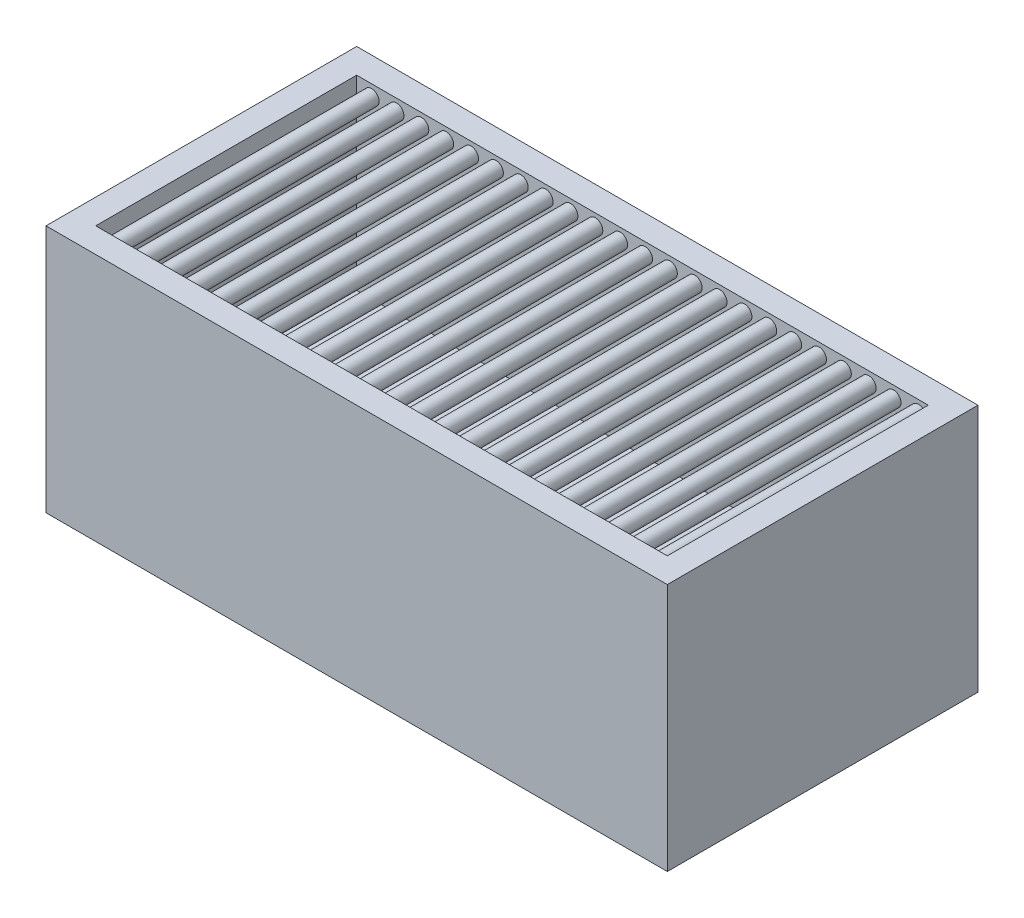
ISO-10303-21;
HEADER;
FILE_DESCRIPTION(('STEP AP214'),'2;1');
FILE_NAME('part.step','',(''),(''),'','','');
FILE_SCHEMA(('AUTOMOTIVE_DESIGN { 1 0 10303 214 1 1 1 1 }'));
ENDSEC;
DATA;
#1=APPLICATION_CONTEXT('core data for automotive mechanical design processes');
#2=APPLICATION_PROTOCOL_DEFINITION('international standard','automotive_design',2000,#1);
#3=PRODUCT_CONTEXT('',#1,'mechanical');
#4=PRODUCT('Part','Part','',(#3));
#5=PRODUCT_RELATED_PRODUCT_CATEGORY('part','',(#4));
#6=PRODUCT_DEFINITION_FORMATION('','',#4);
#7=PRODUCT_DEFINITION_CONTEXT('part definition',#1,'design');
#8=PRODUCT_DEFINITION('design','',#6,#7);
#9=PRODUCT_DEFINITION_SHAPE('','',#8);
#10=(LENGTH_UNIT() NAMED_UNIT(*) SI_UNIT(.MILLI.,.METRE.));
#11=(NAMED_UNIT(*) PLANE_ANGLE_UNIT() SI_UNIT($,.RADIAN.));
#12=(NAMED_UNIT(*) SI_UNIT($,.STERADIAN.) SOLID_ANGLE_UNIT());
#13=UNCERTAINTY_MEASURE_WITH_UNIT(LENGTH_MEASURE(1.E-05),#10,'distance_accuracy_value','');
#14=(GEOMETRIC_REPRESENTATION_CONTEXT(3) GLOBAL_UNCERTAINTY_ASSIGNED_CONTEXT((#13)) GLOBAL_UNIT_ASSIGNED_CONTEXT((#10,
#11,#12)) REPRESENTATION_CONTEXT('',''));
#15=CARTESIAN_POINT('',(0.,0.,0.));
#16=DIRECTION('',(0.,0.,1.));
#17=DIRECTION('',(1.,0.,0.));
#18=AXIS2_PLACEMENT_3D('',#15,#16,#17);
#19=CARTESIAN_POINT('',(-25.,20.,12.5));
#20=DIRECTION('',(1.,0.,0.));
#21=DIRECTION('',(0.,1.,0.));
#22=AXIS2_PLACEMENT_3D('',#19,#20,#21);
#23=PLANE('',#22);
#24=DIRECTION('',(0.,-1.,0.));
#25=VECTOR('',#24,1.);
#26=CARTESIAN_POINT('',(-25.,20.,-12.5));
#27=LINE('',#26,#25);
#28=CARTESIAN_POINT('',(-25.,20.,-12.5));
#29=VERTEX_POINT('',#28);
#30=CARTESIAN_POINT('',(-25.,0.,-12.5));
#31=VERTEX_POINT('',#30);
#32=EDGE_CURVE('E145',#29,#31,#27,.T.);
#33=ORIENTED_EDGE('',*,*,#32,.T.);
#34=DIRECTION('',(0.,0.,-1.));
#35=VECTOR('',#34,1.);
#36=CARTESIAN_POINT('',(-25.,0.,12.5));
#37=LINE('',#36,#35);
#38=CARTESIAN_POINT('',(-25.,0.,12.5));
#39=VERTEX_POINT('',#38);
#40=EDGE_CURVE('E11',#39,#31,#37,.T.);
#41=ORIENTED_EDGE('',*,*,#40,.F.);
#42=DIRECTION('',(0.,-1.,0.));
#43=VECTOR('',#42,1.);
#44=CARTESIAN_POINT('',(-25.,20.,12.5));
#45=LINE('',#44,#43);
#46=CARTESIAN_POINT('',(-25.,20.,12.5));
#47=VERTEX_POINT('',#46);
#48=EDGE_CURVE('E149',#47,#39,#45,.T.);
#49=ORIENTED_EDGE('',*,*,#48,.F.);
#50=DIRECTION('',(0.,0.,-1.));
#51=VECTOR('',#50,1.);
#52=CARTESIAN_POINT('',(-25.,20.,12.5));
#53=LINE('',#52,#51);
#54=EDGE_CURVE('E155',#47,#29,#53,.T.);
#55=ORIENTED_EDGE('',*,*,#54,.T.);
#56=EDGE_LOOP('',(#33,#41,#49,#55));
#57=FACE_BOUND('',#56,.T.);
#58=ADVANCED_FACE('F33',(#57),#23,.F.);
#59=CARTESIAN_POINT('',(-25.,0.,12.5));
#60=DIRECTION('',(0.,1.,0.));
#61=DIRECTION('',(0.,0.,1.));
#62=AXIS2_PLACEMENT_3D('',#59,#60,#61);
#63=PLANE('',#62);
#64=DIRECTION('',(1.,0.,0.));
#65=VECTOR('',#64,1.);
#66=CARTESIAN_POINT('',(-25.,0.,-12.5));
#67=LINE('',#66,#65);
#68=CARTESIAN_POINT('',(25.,0.,-12.5));
#69=VERTEX_POINT('',#68);
#70=EDGE_CURVE('E158',#31,#69,#67,.T.);
#71=ORIENTED_EDGE('',*,*,#70,.T.);
#72=DIRECTION('',(0.,0.,-1.));
#73=VECTOR('',#72,1.);
#74=CARTESIAN_POINT('',(25.,0.,12.5));
#75=LINE('',#74,#73);
#76=CARTESIAN_POINT('',(25.,0.,12.5));
#77=VERTEX_POINT('',#76);
#78=EDGE_CURVE('E40',#77,#69,#75,.T.);
#79=ORIENTED_EDGE('',*,*,#78,.F.);
#80=DIRECTION('',(1.,0.,0.));
#81=VECTOR('',#80,1.);
#82=CARTESIAN_POINT('',(-25.,0.,12.5));
#83=LINE('',#82,#81);
#84=EDGE_CURVE('E84',#39,#77,#83,.T.);
#85=ORIENTED_EDGE('',*,*,#84,.F.);
#86=ORIENTED_EDGE('',*,*,#40,.T.);
#87=EDGE_LOOP('',(#71,#79,#85,#86));
#88=FACE_BOUND('',#87,.T.);
#89=ADVANCED_FACE('F187',(#88),#63,.F.);
#90=CARTESIAN_POINT('',(25.,20.,12.5));
#91=DIRECTION('',(-1.,0.,0.));
#92=DIRECTION('',(0.,-1.,0.));
#93=AXIS2_PLACEMENT_3D('',#90,#91,#92);
#94=PLANE('',#93);
#95=DIRECTION('',(0.,1.,0.));
#96=VECTOR('',#95,1.);
#97=CARTESIAN_POINT('',(25.,20.,-12.5));
#98=LINE('',#97,#96);
#99=CARTESIAN_POINT('',(25.,20.,-12.5));
#100=VERTEX_POINT('',#99);
#101=EDGE_CURVE('E160',#69,#100,#98,.T.);
#102=ORIENTED_EDGE('',*,*,#101,.T.);
#103=DIRECTION('',(0.,0.,-1.));
#104=VECTOR('',#103,1.);
#105=CARTESIAN_POINT('',(25.,20.,12.5));
#106=LINE('',#105,#104);
#107=CARTESIAN_POINT('',(25.,20.,12.5));
#108=VERTEX_POINT('',#107);
#109=EDGE_CURVE('E164',#108,#100,#106,.T.);
#110=ORIENTED_EDGE('',*,*,#109,.F.);
#111=DIRECTION('',(0.,1.,0.));
#112=VECTOR('',#111,1.);
#113=CARTESIAN_POINT('',(25.,20.,12.5));
#114=LINE('',#113,#112);
#115=EDGE_CURVE('E152',#77,#108,#114,.T.);
#116=ORIENTED_EDGE('',*,*,#115,.F.);
#117=ORIENTED_EDGE('',*,*,#78,.T.);
#118=EDGE_LOOP('',(#102,#110,#116,#117));
#119=FACE_BOUND('',#118,.T.);
#120=ADVANCED_FACE('F169',(#119),#94,.F.);
#121=CARTESIAN_POINT('',(-25.,20.,12.5));
#122=DIRECTION('',(0.,-1.,0.));
#123=DIRECTION('',(0.,0.,-1.));
#124=AXIS2_PLACEMENT_3D('',#121,#122,#123);
#125=PLANE('',#124);
#126=DIRECTION('',(0.,0.,1.));
#127=VECTOR('',#126,1.);
#128=CARTESIAN_POINT('',(-23.,20.,12.5));
#129=LINE('',#128,#127);
#130=CARTESIAN_POINT('',(-23.,20.,-10.5));
#131=VERTEX_POINT('',#130);
#132=CARTESIAN_POINT('',(-23.,20.,10.5));
#133=VERTEX_POINT('',#132);
#134=EDGE_CURVE('E138',#131,#133,#129,.T.);
#135=ORIENTED_EDGE('',*,*,#134,.F.);
#136=DIRECTION('',(-1.,0.,0.));
#137=VECTOR('',#136,1.);
#138=CARTESIAN_POINT('',(-25.,20.,-10.5));
#139=LINE('',#138,#137);
#140=CARTESIAN_POINT('',(23.,20.,-10.5));
#141=VERTEX_POINT('',#140);
#142=EDGE_CURVE('E47',#141,#131,#139,.T.);
#143=ORIENTED_EDGE('',*,*,#142,.F.);
#144=DIRECTION('',(0.,0.,-1.));
#145=VECTOR('',#144,1.);
#146=CARTESIAN_POINT('',(23.,20.,12.5));
#147=LINE('',#146,#145);
#148=CARTESIAN_POINT('',(23.,20.,10.5));
#149=VERTEX_POINT('',#148);
#150=EDGE_CURVE('E126',#149,#141,#147,.T.);
#151=ORIENTED_EDGE('',*,*,#150,.F.);
#152=DIRECTION('',(1.,0.,0.));
#153=VECTOR('',#152,1.);
#154=CARTESIAN_POINT('',(-25.,20.,10.5));
#155=LINE('',#154,#153);
#156=EDGE_CURVE('E129',#133,#149,#155,.T.);
#157=ORIENTED_EDGE('',*,*,#156,.F.);
#158=EDGE_LOOP('',(#135,#143,#151,#157));
#159=FACE_BOUND('',#158,.T.);
#160=DIRECTION('',(-1.,0.,0.));
#161=VECTOR('',#160,1.);
#162=CARTESIAN_POINT('',(-25.,20.,-12.5));
#163=LINE('',#162,#161);
#164=EDGE_CURVE('E77',#100,#29,#163,.T.);
#165=ORIENTED_EDGE('',*,*,#164,.T.);
#166=ORIENTED_EDGE('',*,*,#54,.F.);
#167=DIRECTION('',(-1.,0.,0.));
#168=VECTOR('',#167,1.);
#169=CARTESIAN_POINT('',(-25.,20.,12.5));
#170=LINE('',#169,#168);
#171=EDGE_CURVE('E56',#108,#47,#170,.T.);
#172=ORIENTED_EDGE('',*,*,#171,.F.);
#173=ORIENTED_EDGE('',*,*,#109,.T.);
#174=EDGE_LOOP('',(#165,#166,#172,#173));
#175=FACE_BOUND('',#174,.T.);
#176=ADVANCED_FACE('F177',(#159,#175),#125,.F.);
#177=CARTESIAN_POINT('',(0.,0.,12.5));
#178=DIRECTION('',(0.,0.,1.));
#179=DIRECTION('',(1.,0.,0.));
#180=AXIS2_PLACEMENT_3D('',#177,#178,#179);
#181=PLANE('',#180);
#182=ORIENTED_EDGE('',*,*,#48,.T.);
#183=ORIENTED_EDGE('',*,*,#84,.T.);
#184=ORIENTED_EDGE('',*,*,#115,.T.);
#185=ORIENTED_EDGE('',*,*,#171,.T.);
#186=EDGE_LOOP('',(#182,#183,#184,#185));
#187=FACE_BOUND('',#186,.T.);
#188=ADVANCED_FACE('F179',(#187),#181,.T.);
#189=CARTESIAN_POINT('',(0.,0.,-12.5));
#190=DIRECTION('',(0.,0.,1.));
#191=DIRECTION('',(1.,0.,0.));
#192=AXIS2_PLACEMENT_3D('',#189,#190,#191);
#193=PLANE('',#192);
#194=ORIENTED_EDGE('',*,*,#32,.F.);
#195=ORIENTED_EDGE('',*,*,#164,.F.);
#196=ORIENTED_EDGE('',*,*,#101,.F.);
#197=ORIENTED_EDGE('',*,*,#70,.F.);
#198=EDGE_LOOP('',(#194,#195,#196,#197));
#199=FACE_BOUND('',#198,.T.);
#200=ADVANCED_FACE('F173',(#199),#193,.F.);
#201=CARTESIAN_POINT('',(-25.,5.,-10.5));
#202=DIRECTION('',(0.,0.,-1.));
#203=DIRECTION('',(-1.,0.,0.));
#204=AXIS2_PLACEMENT_3D('',#201,#202,#203);
#205=PLANE('',#204);
#206=CARTESIAN_POINT('',(22.2050358480164,19.0651435562582,-10.5));
#207=DIRECTION('',(0.,0.,-1.));
#208=DIRECTION('',(-1.,0.,0.));
#209=AXIS2_PLACEMENT_3D('',#206,#207,#208);
#210=CIRCLE('',#209,0.6);
#211=CARTESIAN_POINT('',(21.6050358480164,19.0651435562582,-10.5));
#212=VERTEX_POINT('',#211);
#213=EDGE_CURVE('E502',#212,#212,#210,.T.);
#214=ORIENTED_EDGE('',*,*,#213,.T.);
#215=EDGE_LOOP('',(#214));
#216=FACE_BOUND('',#215,.T.);
#217=CARTESIAN_POINT('',(20.2050358480164,19.0651435562582,-10.5));
#218=DIRECTION('',(0.,0.,-1.));
#219=DIRECTION('',(-1.,0.,0.));
#220=AXIS2_PLACEMENT_3D('',#217,#218,#219);
#221=CIRCLE('',#220,0.6);
#222=CARTESIAN_POINT('',(19.6050358480164,19.0651435562582,-10.5));
#223=VERTEX_POINT('',#222);
#224=EDGE_CURVE('E504',#223,#223,#221,.T.);
#225=ORIENTED_EDGE('',*,*,#224,.T.);
#226=EDGE_LOOP('',(#225));
#227=FACE_BOUND('',#226,.T.);
#228=CARTESIAN_POINT('',(18.2050358480164,19.0651435562582,-10.5));
#229=DIRECTION('',(0.,0.,-1.));
#230=DIRECTION('',(-1.,0.,0.));
#231=AXIS2_PLACEMENT_3D('',#228,#229,#230);
#232=CIRCLE('',#231,0.6);
#233=CARTESIAN_POINT('',(17.6050358480164,19.0651435562582,-10.5));
#234=VERTEX_POINT('',#233);
#235=EDGE_CURVE('E510',#234,#234,#232,.T.);
#236=ORIENTED_EDGE('',*,*,#235,.T.);
#237=EDGE_LOOP('',(#236));
#238=FACE_BOUND('',#237,.T.);
#239=CARTESIAN_POINT('',(16.2050358480164,19.0651435562582,-10.5));
#240=DIRECTION('',(0.,0.,-1.));
#241=DIRECTION('',(-1.,0.,0.));
#242=AXIS2_PLACEMENT_3D('',#239,#240,#241);
#243=CIRCLE('',#242,0.6);
#244=CARTESIAN_POINT('',(15.6050358480164,19.0651435562582,-10.5));
#245=VERTEX_POINT('',#244);
#246=EDGE_CURVE('E516',#245,#245,#243,.T.);
#247=ORIENTED_EDGE('',*,*,#246,.T.);
#248=EDGE_LOOP('',(#247));
#249=FACE_BOUND('',#248,.T.);
#250=CARTESIAN_POINT('',(14.2050358480164,19.0651435562582,-10.5));
#251=DIRECTION('',(0.,0.,-1.));
#252=DIRECTION('',(-1.,0.,0.));
#253=AXIS2_PLACEMENT_3D('',#250,#251,#252);
#254=CIRCLE('',#253,0.6);
#255=CARTESIAN_POINT('',(13.6050358480164,19.0651435562582,-10.5));
#256=VERTEX_POINT('',#255);
#257=EDGE_CURVE('E522',#256,#256,#254,.T.);
#258=ORIENTED_EDGE('',*,*,#257,.T.);
#259=EDGE_LOOP('',(#258));
#260=FACE_BOUND('',#259,.T.);
#261=CARTESIAN_POINT('',(12.2050358480164,19.0651435562582,-10.5));
#262=DIRECTION('',(0.,0.,-1.));
#263=DIRECTION('',(-1.,0.,0.));
#264=AXIS2_PLACEMENT_3D('',#261,#262,#263);
#265=CIRCLE('',#264,0.6);
#266=CARTESIAN_POINT('',(11.6050358480164,19.0651435562582,-10.5));
#267=VERTEX_POINT('',#266);
#268=EDGE_CURVE('E528',#267,#267,#265,.T.);
#269=ORIENTED_EDGE('',*,*,#268,.T.);
#270=EDGE_LOOP('',(#269));
#271=FACE_BOUND('',#270,.T.);
#272=CARTESIAN_POINT('',(10.2050358480164,19.0651435562582,-10.5));
#273=DIRECTION('',(0.,0.,-1.));
#274=DIRECTION('',(-1.,0.,0.));
#275=AXIS2_PLACEMENT_3D('',#272,#273,#274);
#276=CIRCLE('',#275,0.6);
#277=CARTESIAN_POINT('',(9.60503584801644,19.0651435562582,-10.5));
#278=VERTEX_POINT('',#277);
#279=EDGE_CURVE('E534',#278,#278,#276,.T.);
#280=ORIENTED_EDGE('',*,*,#279,.T.);
#281=EDGE_LOOP('',(#280));
#282=FACE_BOUND('',#281,.T.);
#283=CARTESIAN_POINT('',(8.20503584801644,19.0651435562582,-10.5));
#284=DIRECTION('',(0.,0.,-1.));
#285=DIRECTION('',(-1.,0.,0.));
#286=AXIS2_PLACEMENT_3D('',#283,#284,#285);
#287=CIRCLE('',#286,0.6);
#288=CARTESIAN_POINT('',(7.60503584801644,19.0651435562582,-10.5));
#289=VERTEX_POINT('',#288);
#290=EDGE_CURVE('E540',#289,#289,#287,.T.);
#291=ORIENTED_EDGE('',*,*,#290,.T.);
#292=EDGE_LOOP('',(#291));
#293=FACE_BOUND('',#292,.T.);
#294=CARTESIAN_POINT('',(6.20503584801644,19.0651435562582,-10.5));
#295=DIRECTION('',(0.,0.,-1.));
#296=DIRECTION('',(-1.,0.,0.));
#297=AXIS2_PLACEMENT_3D('',#294,#295,#296);
#298=CIRCLE('',#297,0.6);
#299=CARTESIAN_POINT('',(5.60503584801644,19.0651435562582,-10.5));
#300=VERTEX_POINT('',#299);
#301=EDGE_CURVE('E546',#300,#300,#298,.T.);
#302=ORIENTED_EDGE('',*,*,#301,.T.);
#303=EDGE_LOOP('',(#302));
#304=FACE_BOUND('',#303,.T.);
#305=CARTESIAN_POINT('',(4.20503584801644,19.0651435562582,-10.5));
#306=DIRECTION('',(0.,0.,-1.));
#307=DIRECTION('',(-1.,0.,0.));
#308=AXIS2_PLACEMENT_3D('',#305,#306,#307);
#309=CIRCLE('',#308,0.6);
#310=CARTESIAN_POINT('',(3.60503584801644,19.0651435562582,-10.5));
#311=VERTEX_POINT('',#310);
#312=EDGE_CURVE('E552',#311,#311,#309,.T.);
#313=ORIENTED_EDGE('',*,*,#312,.T.);
#314=EDGE_LOOP('',(#313));
#315=FACE_BOUND('',#314,.T.);
#316=CARTESIAN_POINT('',(2.20503584801644,19.0651435562582,-10.5));
#317=DIRECTION('',(0.,0.,-1.));
#318=DIRECTION('',(-1.,0.,0.));
#319=AXIS2_PLACEMENT_3D('',#316,#317,#318);
#320=CIRCLE('',#319,0.6);
#321=CARTESIAN_POINT('',(1.60503584801644,19.0651435562582,-10.5));
#322=VERTEX_POINT('',#321);
#323=EDGE_CURVE('E558',#322,#322,#320,.T.);
#324=ORIENTED_EDGE('',*,*,#323,.T.);
#325=EDGE_LOOP('',(#324));
#326=FACE_BOUND('',#325,.T.);
#327=CARTESIAN_POINT('',(0.205035848016441,19.0651435562582,-10.5));
#328=DIRECTION('',(0.,0.,-1.));
#329=DIRECTION('',(-1.,0.,0.));
#330=AXIS2_PLACEMENT_3D('',#327,#328,#329);
#331=CIRCLE('',#330,0.6);
#332=CARTESIAN_POINT('',(-0.394964151983559,19.0651435562582,-10.5));
#333=VERTEX_POINT('',#332);
#334=EDGE_CURVE('E564',#333,#333,#331,.T.);
#335=ORIENTED_EDGE('',*,*,#334,.T.);
#336=EDGE_LOOP('',(#335));
#337=FACE_BOUND('',#336,.T.);
#338=CARTESIAN_POINT('',(-1.79496415198356,19.0651435562582,-10.5));
#339=DIRECTION('',(0.,0.,-1.));
#340=DIRECTION('',(-1.,0.,0.));
#341=AXIS2_PLACEMENT_3D('',#338,#339,#340);
#342=CIRCLE('',#341,0.6);
#343=CARTESIAN_POINT('',(-2.39496415198356,19.0651435562582,-10.5));
#344=VERTEX_POINT('',#343);
#345=EDGE_CURVE('E570',#344,#344,#342,.T.);
#346=ORIENTED_EDGE('',*,*,#345,.T.);
#347=EDGE_LOOP('',(#346));
#348=FACE_BOUND('',#347,.T.);
#349=CARTESIAN_POINT('',(-3.79496415198356,19.0651435562582,-10.5));
#350=DIRECTION('',(0.,0.,-1.));
#351=DIRECTION('',(-1.,0.,0.));
#352=AXIS2_PLACEMENT_3D('',#349,#350,#351);
#353=CIRCLE('',#352,0.6);
#354=CARTESIAN_POINT('',(-4.39496415198356,19.0651435562582,-10.5));
#355=VERTEX_POINT('',#354);
#356=EDGE_CURVE('E576',#355,#355,#353,.T.);
#357=ORIENTED_EDGE('',*,*,#356,.T.);
#358=EDGE_LOOP('',(#357));
#359=FACE_BOUND('',#358,.T.);
#360=CARTESIAN_POINT('',(-5.79496415198356,19.0651435562582,-10.5));
#361=DIRECTION('',(0.,0.,-1.));
#362=DIRECTION('',(-1.,0.,0.));
#363=AXIS2_PLACEMENT_3D('',#360,#361,#362);
#364=CIRCLE('',#363,0.6);
#365=CARTESIAN_POINT('',(-6.39496415198356,19.0651435562582,-10.5));
#366=VERTEX_POINT('',#365);
#367=EDGE_CURVE('E582',#366,#366,#364,.T.);
#368=ORIENTED_EDGE('',*,*,#367,.T.);
#369=EDGE_LOOP('',(#368));
#370=FACE_BOUND('',#369,.T.);
#371=CARTESIAN_POINT('',(-7.79496415198356,19.0651435562582,-10.5));
#372=DIRECTION('',(0.,0.,-1.));
#373=DIRECTION('',(-1.,0.,0.));
#374=AXIS2_PLACEMENT_3D('',#371,#372,#373);
#375=CIRCLE('',#374,0.6);
#376=CARTESIAN_POINT('',(-8.39496415198356,19.0651435562582,-10.5));
#377=VERTEX_POINT('',#376);
#378=EDGE_CURVE('E588',#377,#377,#375,.T.);
#379=ORIENTED_EDGE('',*,*,#378,.T.);
#380=EDGE_LOOP('',(#379));
#381=FACE_BOUND('',#380,.T.);
#382=CARTESIAN_POINT('',(-9.79496415198356,19.0651435562582,-10.5));
#383=DIRECTION('',(0.,0.,-1.));
#384=DIRECTION('',(-1.,0.,0.));
#385=AXIS2_PLACEMENT_3D('',#382,#383,#384);
#386=CIRCLE('',#385,0.6);
#387=CARTESIAN_POINT('',(-10.3949641519836,19.0651435562582,-10.5));
#388=VERTEX_POINT('',#387);
#389=EDGE_CURVE('E594',#388,#388,#386,.T.);
#390=ORIENTED_EDGE('',*,*,#389,.T.);
#391=EDGE_LOOP('',(#390));
#392=FACE_BOUND('',#391,.T.);
#393=CARTESIAN_POINT('',(-11.7949641519836,19.0651435562582,-10.5));
#394=DIRECTION('',(0.,0.,-1.));
#395=DIRECTION('',(-1.,0.,0.));
#396=AXIS2_PLACEMENT_3D('',#393,#394,#395);
#397=CIRCLE('',#396,0.6);
#398=CARTESIAN_POINT('',(-12.3949641519836,19.0651435562582,-10.5));
#399=VERTEX_POINT('',#398);
#400=EDGE_CURVE('E600',#399,#399,#397,.T.);
#401=ORIENTED_EDGE('',*,*,#400,.T.);
#402=EDGE_LOOP('',(#401));
#403=FACE_BOUND('',#402,.T.);
#404=CARTESIAN_POINT('',(-13.7949641519836,19.0651435562582,-10.5));
#405=DIRECTION('',(0.,0.,-1.));
#406=DIRECTION('',(-1.,0.,0.));
#407=AXIS2_PLACEMENT_3D('',#404,#405,#406);
#408=CIRCLE('',#407,0.6);
#409=CARTESIAN_POINT('',(-14.3949641519836,19.0651435562582,-10.5));
#410=VERTEX_POINT('',#409);
#411=EDGE_CURVE('E606',#410,#410,#408,.T.);
#412=ORIENTED_EDGE('',*,*,#411,.T.);
#413=EDGE_LOOP('',(#412));
#414=FACE_BOUND('',#413,.T.);
#415=CARTESIAN_POINT('',(-15.7949641519836,19.0651435562582,-10.5));
#416=DIRECTION('',(0.,0.,-1.));
#417=DIRECTION('',(-1.,0.,0.));
#418=AXIS2_PLACEMENT_3D('',#415,#416,#417);
#419=CIRCLE('',#418,0.600000000000002);
#420=CARTESIAN_POINT('',(-16.3949641519836,19.0651435562582,-10.5));
#421=VERTEX_POINT('',#420);
#422=EDGE_CURVE('E612',#421,#421,#419,.T.);
#423=ORIENTED_EDGE('',*,*,#422,.T.);
#424=EDGE_LOOP('',(#423));
#425=FACE_BOUND('',#424,.T.);
#426=CARTESIAN_POINT('',(-17.7949641519836,19.0651435562582,-10.5));
#427=DIRECTION('',(0.,0.,-1.));
#428=DIRECTION('',(-1.,0.,0.));
#429=AXIS2_PLACEMENT_3D('',#426,#427,#428);
#430=CIRCLE('',#429,0.6);
#431=CARTESIAN_POINT('',(-18.3949641519836,19.0651435562582,-10.5));
#432=VERTEX_POINT('',#431);
#433=EDGE_CURVE('E618',#432,#432,#430,.T.);
#434=ORIENTED_EDGE('',*,*,#433,.T.);
#435=EDGE_LOOP('',(#434));
#436=FACE_BOUND('',#435,.T.);
#437=CARTESIAN_POINT('',(-19.7949641519836,19.0651435562582,-10.5));
#438=DIRECTION('',(0.,0.,-1.));
#439=DIRECTION('',(-1.,0.,0.));
#440=AXIS2_PLACEMENT_3D('',#437,#438,#439);
#441=CIRCLE('',#440,0.6);
#442=CARTESIAN_POINT('',(-20.3949641519836,19.0651435562582,-10.5));
#443=VERTEX_POINT('',#442);
#444=EDGE_CURVE('E624',#443,#443,#441,.T.);
#445=ORIENTED_EDGE('',*,*,#444,.T.);
#446=EDGE_LOOP('',(#445));
#447=FACE_BOUND('',#446,.T.);
#448=CARTESIAN_POINT('',(-21.7949641519836,19.0651435562582,-10.5));
#449=DIRECTION('',(0.,0.,-1.));
#450=DIRECTION('',(-1.,0.,0.));
#451=AXIS2_PLACEMENT_3D('',#448,#449,#450);
#452=CIRCLE('',#451,0.6);
#453=CARTESIAN_POINT('',(-22.3949641519836,19.0651435562582,-10.5));
#454=VERTEX_POINT('',#453);
#455=EDGE_CURVE('E132',#454,#454,#452,.T.);
#456=ORIENTED_EDGE('',*,*,#455,.T.);
#457=EDGE_LOOP('',(#456));
#458=FACE_BOUND('',#457,.T.);
#459=ORIENTED_EDGE('',*,*,#142,.T.);
#460=DIRECTION('',(0.,1.,0.));
#461=VECTOR('',#460,1.);
#462=CARTESIAN_POINT('',(-23.,5.,-10.5));
#463=LINE('',#462,#461);
#464=CARTESIAN_POINT('',(-23.,5.,-10.5));
#465=VERTEX_POINT('',#464);
#466=EDGE_CURVE('E104',#465,#131,#463,.T.);
#467=ORIENTED_EDGE('',*,*,#466,.F.);
#468=DIRECTION('',(-1.,0.,0.));
#469=VECTOR('',#468,1.);
#470=CARTESIAN_POINT('',(-25.,5.,-10.5));
#471=LINE('',#470,#469);
#472=CARTESIAN_POINT('',(23.,5.,-10.5));
#473=VERTEX_POINT('',#472);
#474=EDGE_CURVE('E108',#473,#465,#471,.T.);
#475=ORIENTED_EDGE('',*,*,#474,.F.);
#476=DIRECTION('',(0.,1.,0.));
#477=VECTOR('',#476,1.);
#478=CARTESIAN_POINT('',(23.,5.,-10.5));
#479=LINE('',#478,#477);
#480=EDGE_CURVE('E143',#473,#141,#479,.T.);
#481=ORIENTED_EDGE('',*,*,#480,.T.);
#482=EDGE_LOOP('',(#459,#467,#475,#481));
#483=FACE_BOUND('',#482,.T.);
#484=ADVANCED_FACE('F106',(#216,#227,#238,#249,#260,#271,#282,#293,#304,#315,#326,#337,#348,
#359,#370,#381,#392,#403,#414,#425,#436,#447,#458,#483),#205,.F.);
#485=CARTESIAN_POINT('',(23.,5.,12.5));
#486=DIRECTION('',(1.,0.,0.));
#487=DIRECTION('',(0.,0.,-1.));
#488=AXIS2_PLACEMENT_3D('',#485,#486,#487);
#489=PLANE('',#488);
#490=ORIENTED_EDGE('',*,*,#150,.T.);
#491=ORIENTED_EDGE('',*,*,#480,.F.);
#492=DIRECTION('',(0.,0.,-1.));
#493=VECTOR('',#492,1.);
#494=CARTESIAN_POINT('',(23.,5.,12.5));
#495=LINE('',#494,#493);
#496=CARTESIAN_POINT('',(23.,5.,10.5));
#497=VERTEX_POINT('',#496);
#498=EDGE_CURVE('E114',#497,#473,#495,.T.);
#499=ORIENTED_EDGE('',*,*,#498,.F.);
#500=DIRECTION('',(0.,1.,0.));
#501=VECTOR('',#500,1.);
#502=CARTESIAN_POINT('',(23.,5.,10.5));
#503=LINE('',#502,#501);
#504=EDGE_CURVE('E146',#497,#149,#503,.T.);
#505=ORIENTED_EDGE('',*,*,#504,.T.);
#506=EDGE_LOOP('',(#490,#491,#499,#505));
#507=FACE_BOUND('',#506,.T.);
#508=ADVANCED_FACE('F224',(#507),#489,.F.);
#509=CARTESIAN_POINT('',(-25.,5.,10.5));
#510=DIRECTION('',(0.,0.,1.));
#511=DIRECTION('',(1.,0.,0.));
#512=AXIS2_PLACEMENT_3D('',#509,#510,#511);
#513=PLANE('',#512);
#514=CARTESIAN_POINT('',(22.2050358480164,19.0651435562582,10.5));
#515=DIRECTION('',(0.,0.,-1.));
#516=DIRECTION('',(-1.,0.,0.));
#517=AXIS2_PLACEMENT_3D('',#514,#515,#516);
#518=CIRCLE('',#517,0.6);
#519=CARTESIAN_POINT('',(21.6050358480164,19.0651435562582,10.5));
#520=VERTEX_POINT('',#519);
#521=EDGE_CURVE('E499',#520,#520,#518,.T.);
#522=ORIENTED_EDGE('',*,*,#521,.F.);
#523=EDGE_LOOP('',(#522));
#524=FACE_BOUND('',#523,.T.);
#525=CARTESIAN_POINT('',(20.2050358480164,19.0651435562582,10.5));
#526=DIRECTION('',(0.,0.,-1.));
#527=DIRECTION('',(-1.,0.,0.));
#528=AXIS2_PLACEMENT_3D('',#525,#526,#527);
#529=CIRCLE('',#528,0.6);
#530=CARTESIAN_POINT('',(19.6050358480164,19.0651435562582,10.5));
#531=VERTEX_POINT('',#530);
#532=EDGE_CURVE('E507',#531,#531,#529,.T.);
#533=ORIENTED_EDGE('',*,*,#532,.F.);
#534=EDGE_LOOP('',(#533));
#535=FACE_BOUND('',#534,.T.);
#536=CARTESIAN_POINT('',(18.2050358480164,19.0651435562582,10.5));
#537=DIRECTION('',(0.,0.,-1.));
#538=DIRECTION('',(-1.,0.,0.));
#539=AXIS2_PLACEMENT_3D('',#536,#537,#538);
#540=CIRCLE('',#539,0.6);
#541=CARTESIAN_POINT('',(17.6050358480164,19.0651435562582,10.5));
#542=VERTEX_POINT('',#541);
#543=EDGE_CURVE('E513',#542,#542,#540,.T.);
#544=ORIENTED_EDGE('',*,*,#543,.F.);
#545=EDGE_LOOP('',(#544));
#546=FACE_BOUND('',#545,.T.);
#547=CARTESIAN_POINT('',(16.2050358480164,19.0651435562582,10.5));
#548=DIRECTION('',(0.,0.,-1.));
#549=DIRECTION('',(-1.,0.,0.));
#550=AXIS2_PLACEMENT_3D('',#547,#548,#549);
#551=CIRCLE('',#550,0.6);
#552=CARTESIAN_POINT('',(15.6050358480164,19.0651435562582,10.5));
#553=VERTEX_POINT('',#552);
#554=EDGE_CURVE('E519',#553,#553,#551,.T.);
#555=ORIENTED_EDGE('',*,*,#554,.F.);
#556=EDGE_LOOP('',(#555));
#557=FACE_BOUND('',#556,.T.);
#558=CARTESIAN_POINT('',(14.2050358480164,19.0651435562582,10.5));
#559=DIRECTION('',(0.,0.,-1.));
#560=DIRECTION('',(-1.,0.,0.));
#561=AXIS2_PLACEMENT_3D('',#558,#559,#560);
#562=CIRCLE('',#561,0.6);
#563=CARTESIAN_POINT('',(13.6050358480164,19.0651435562582,10.5));
#564=VERTEX_POINT('',#563);
#565=EDGE_CURVE('E525',#564,#564,#562,.T.);
#566=ORIENTED_EDGE('',*,*,#565,.F.);
#567=EDGE_LOOP('',(#566));
#568=FACE_BOUND('',#567,.T.);
#569=CARTESIAN_POINT('',(12.2050358480164,19.0651435562582,10.5));
#570=DIRECTION('',(0.,0.,-1.));
#571=DIRECTION('',(-1.,0.,0.));
#572=AXIS2_PLACEMENT_3D('',#569,#570,#571);
#573=CIRCLE('',#572,0.6);
#574=CARTESIAN_POINT('',(11.6050358480164,19.0651435562582,10.5));
#575=VERTEX_POINT('',#574);
#576=EDGE_CURVE('E531',#575,#575,#573,.T.);
#577=ORIENTED_EDGE('',*,*,#576,.F.);
#578=EDGE_LOOP('',(#577));
#579=FACE_BOUND('',#578,.T.);
#580=CARTESIAN_POINT('',(10.2050358480164,19.0651435562582,10.5));
#581=DIRECTION('',(0.,0.,-1.));
#582=DIRECTION('',(-1.,0.,0.));
#583=AXIS2_PLACEMENT_3D('',#580,#581,#582);
#584=CIRCLE('',#583,0.6);
#585=CARTESIAN_POINT('',(9.60503584801644,19.0651435562582,10.5));
#586=VERTEX_POINT('',#585);
#587=EDGE_CURVE('E537',#586,#586,#584,.T.);
#588=ORIENTED_EDGE('',*,*,#587,.F.);
#589=EDGE_LOOP('',(#588));
#590=FACE_BOUND('',#589,.T.);
#591=CARTESIAN_POINT('',(8.20503584801644,19.0651435562582,10.5));
#592=DIRECTION('',(0.,0.,-1.));
#593=DIRECTION('',(-1.,0.,0.));
#594=AXIS2_PLACEMENT_3D('',#591,#592,#593);
#595=CIRCLE('',#594,0.6);
#596=CARTESIAN_POINT('',(7.60503584801644,19.0651435562582,10.5));
#597=VERTEX_POINT('',#596);
#598=EDGE_CURVE('E543',#597,#597,#595,.T.);
#599=ORIENTED_EDGE('',*,*,#598,.F.);
#600=EDGE_LOOP('',(#599));
#601=FACE_BOUND('',#600,.T.);
#602=CARTESIAN_POINT('',(6.20503584801644,19.0651435562582,10.5));
#603=DIRECTION('',(0.,0.,-1.));
#604=DIRECTION('',(-1.,0.,0.));
#605=AXIS2_PLACEMENT_3D('',#602,#603,#604);
#606=CIRCLE('',#605,0.6);
#607=CARTESIAN_POINT('',(5.60503584801644,19.0651435562582,10.5));
#608=VERTEX_POINT('',#607);
#609=EDGE_CURVE('E549',#608,#608,#606,.T.);
#610=ORIENTED_EDGE('',*,*,#609,.F.);
#611=EDGE_LOOP('',(#610));
#612=FACE_BOUND('',#611,.T.);
#613=CARTESIAN_POINT('',(4.20503584801644,19.0651435562582,10.5));
#614=DIRECTION('',(0.,0.,-1.));
#615=DIRECTION('',(-1.,0.,0.));
#616=AXIS2_PLACEMENT_3D('',#613,#614,#615);
#617=CIRCLE('',#616,0.6);
#618=CARTESIAN_POINT('',(3.60503584801644,19.0651435562582,10.5));
#619=VERTEX_POINT('',#618);
#620=EDGE_CURVE('E555',#619,#619,#617,.T.);
#621=ORIENTED_EDGE('',*,*,#620,.F.);
#622=EDGE_LOOP('',(#621));
#623=FACE_BOUND('',#622,.T.);
#624=CARTESIAN_POINT('',(2.20503584801644,19.0651435562582,10.5));
#625=DIRECTION('',(0.,0.,-1.));
#626=DIRECTION('',(-1.,0.,0.));
#627=AXIS2_PLACEMENT_3D('',#624,#625,#626);
#628=CIRCLE('',#627,0.6);
#629=CARTESIAN_POINT('',(1.60503584801644,19.0651435562582,10.5));
#630=VERTEX_POINT('',#629);
#631=EDGE_CURVE('E561',#630,#630,#628,.T.);
#632=ORIENTED_EDGE('',*,*,#631,.F.);
#633=EDGE_LOOP('',(#632));
#634=FACE_BOUND('',#633,.T.);
#635=CARTESIAN_POINT('',(0.205035848016441,19.0651435562582,10.5));
#636=DIRECTION('',(0.,0.,-1.));
#637=DIRECTION('',(-1.,0.,0.));
#638=AXIS2_PLACEMENT_3D('',#635,#636,#637);
#639=CIRCLE('',#638,0.6);
#640=CARTESIAN_POINT('',(-0.394964151983559,19.0651435562582,10.5));
#641=VERTEX_POINT('',#640);
#642=EDGE_CURVE('E567',#641,#641,#639,.T.);
#643=ORIENTED_EDGE('',*,*,#642,.F.);
#644=EDGE_LOOP('',(#643));
#645=FACE_BOUND('',#644,.T.);
#646=CARTESIAN_POINT('',(-1.79496415198356,19.0651435562582,10.5));
#647=DIRECTION('',(0.,0.,-1.));
#648=DIRECTION('',(-1.,0.,0.));
#649=AXIS2_PLACEMENT_3D('',#646,#647,#648);
#650=CIRCLE('',#649,0.6);
#651=CARTESIAN_POINT('',(-2.39496415198356,19.0651435562582,10.5));
#652=VERTEX_POINT('',#651);
#653=EDGE_CURVE('E573',#652,#652,#650,.T.);
#654=ORIENTED_EDGE('',*,*,#653,.F.);
#655=EDGE_LOOP('',(#654));
#656=FACE_BOUND('',#655,.T.);
#657=CARTESIAN_POINT('',(-3.79496415198356,19.0651435562582,10.5));
#658=DIRECTION('',(0.,0.,-1.));
#659=DIRECTION('',(-1.,0.,0.));
#660=AXIS2_PLACEMENT_3D('',#657,#658,#659);
#661=CIRCLE('',#660,0.6);
#662=CARTESIAN_POINT('',(-4.39496415198356,19.0651435562582,10.5));
#663=VERTEX_POINT('',#662);
#664=EDGE_CURVE('E579',#663,#663,#661,.T.);
#665=ORIENTED_EDGE('',*,*,#664,.F.);
#666=EDGE_LOOP('',(#665));
#667=FACE_BOUND('',#666,.T.);
#668=CARTESIAN_POINT('',(-5.79496415198356,19.0651435562582,10.5));
#669=DIRECTION('',(0.,0.,-1.));
#670=DIRECTION('',(-1.,0.,0.));
#671=AXIS2_PLACEMENT_3D('',#668,#669,#670);
#672=CIRCLE('',#671,0.6);
#673=CARTESIAN_POINT('',(-6.39496415198356,19.0651435562582,10.5));
#674=VERTEX_POINT('',#673);
#675=EDGE_CURVE('E585',#674,#674,#672,.T.);
#676=ORIENTED_EDGE('',*,*,#675,.F.);
#677=EDGE_LOOP('',(#676));
#678=FACE_BOUND('',#677,.T.);
#679=CARTESIAN_POINT('',(-7.79496415198356,19.0651435562582,10.5));
#680=DIRECTION('',(0.,0.,-1.));
#681=DIRECTION('',(-1.,0.,0.));
#682=AXIS2_PLACEMENT_3D('',#679,#680,#681);
#683=CIRCLE('',#682,0.6);
#684=CARTESIAN_POINT('',(-8.39496415198356,19.0651435562582,10.5));
#685=VERTEX_POINT('',#684);
#686=EDGE_CURVE('E591',#685,#685,#683,.T.);
#687=ORIENTED_EDGE('',*,*,#686,.F.);
#688=EDGE_LOOP('',(#687));
#689=FACE_BOUND('',#688,.T.);
#690=CARTESIAN_POINT('',(-9.79496415198356,19.0651435562582,10.5));
#691=DIRECTION('',(0.,0.,-1.));
#692=DIRECTION('',(-1.,0.,0.));
#693=AXIS2_PLACEMENT_3D('',#690,#691,#692);
#694=CIRCLE('',#693,0.6);
#695=CARTESIAN_POINT('',(-10.3949641519836,19.0651435562582,10.5));
#696=VERTEX_POINT('',#695);
#697=EDGE_CURVE('E597',#696,#696,#694,.T.);
#698=ORIENTED_EDGE('',*,*,#697,.F.);
#699=EDGE_LOOP('',(#698));
#700=FACE_BOUND('',#699,.T.);
#701=CARTESIAN_POINT('',(-11.7949641519836,19.0651435562582,10.5));
#702=DIRECTION('',(0.,0.,-1.));
#703=DIRECTION('',(-1.,0.,0.));
#704=AXIS2_PLACEMENT_3D('',#701,#702,#703);
#705=CIRCLE('',#704,0.6);
#706=CARTESIAN_POINT('',(-12.3949641519836,19.0651435562582,10.5));
#707=VERTEX_POINT('',#706);
#708=EDGE_CURVE('E603',#707,#707,#705,.T.);
#709=ORIENTED_EDGE('',*,*,#708,.F.);
#710=EDGE_LOOP('',(#709));
#711=FACE_BOUND('',#710,.T.);
#712=CARTESIAN_POINT('',(-13.7949641519836,19.0651435562582,10.5));
#713=DIRECTION('',(0.,0.,-1.));
#714=DIRECTION('',(-1.,0.,0.));
#715=AXIS2_PLACEMENT_3D('',#712,#713,#714);
#716=CIRCLE('',#715,0.6);
#717=CARTESIAN_POINT('',(-14.3949641519836,19.0651435562582,10.5));
#718=VERTEX_POINT('',#717);
#719=EDGE_CURVE('E609',#718,#718,#716,.T.);
#720=ORIENTED_EDGE('',*,*,#719,.F.);
#721=EDGE_LOOP('',(#720));
#722=FACE_BOUND('',#721,.T.);
#723=CARTESIAN_POINT('',(-15.7949641519836,19.0651435562582,10.5));
#724=DIRECTION('',(0.,0.,-1.));
#725=DIRECTION('',(-1.,0.,0.));
#726=AXIS2_PLACEMENT_3D('',#723,#724,#725);
#727=CIRCLE('',#726,0.600000000000002);
#728=CARTESIAN_POINT('',(-16.3949641519836,19.0651435562582,10.5));
#729=VERTEX_POINT('',#728);
#730=EDGE_CURVE('E615',#729,#729,#727,.T.);
#731=ORIENTED_EDGE('',*,*,#730,.F.);
#732=EDGE_LOOP('',(#731));
#733=FACE_BOUND('',#732,.T.);
#734=CARTESIAN_POINT('',(-17.7949641519836,19.0651435562582,10.5));
#735=DIRECTION('',(0.,0.,-1.));
#736=DIRECTION('',(-1.,0.,0.));
#737=AXIS2_PLACEMENT_3D('',#734,#735,#736);
#738=CIRCLE('',#737,0.6);
#739=CARTESIAN_POINT('',(-18.3949641519836,19.0651435562582,10.5));
#740=VERTEX_POINT('',#739);
#741=EDGE_CURVE('E621',#740,#740,#738,.T.);
#742=ORIENTED_EDGE('',*,*,#741,.F.);
#743=EDGE_LOOP('',(#742));
#744=FACE_BOUND('',#743,.T.);
#745=CARTESIAN_POINT('',(-19.7949641519836,19.0651435562582,10.5));
#746=DIRECTION('',(0.,0.,-1.));
#747=DIRECTION('',(-1.,0.,0.));
#748=AXIS2_PLACEMENT_3D('',#745,#746,#747);
#749=CIRCLE('',#748,0.6);
#750=CARTESIAN_POINT('',(-20.3949641519836,19.0651435562582,10.5));
#751=VERTEX_POINT('',#750);
#752=EDGE_CURVE('E627',#751,#751,#749,.T.);
#753=ORIENTED_EDGE('',*,*,#752,.F.);
#754=EDGE_LOOP('',(#753));
#755=FACE_BOUND('',#754,.T.);
#756=CARTESIAN_POINT('',(-21.7949641519836,19.0651435562582,10.5));
#757=DIRECTION('',(0.,0.,-1.));
#758=DIRECTION('',(-1.,0.,0.));
#759=AXIS2_PLACEMENT_3D('',#756,#757,#758);
#760=CIRCLE('',#759,0.6);
#761=CARTESIAN_POINT('',(-22.3949641519836,19.0651435562582,10.5));
#762=VERTEX_POINT('',#761);
#763=EDGE_CURVE('E139',#762,#762,#760,.T.);
#764=ORIENTED_EDGE('',*,*,#763,.F.);
#765=EDGE_LOOP('',(#764));
#766=FACE_BOUND('',#765,.T.);
#767=ORIENTED_EDGE('',*,*,#156,.T.);
#768=ORIENTED_EDGE('',*,*,#504,.F.);
#769=DIRECTION('',(1.,0.,0.));
#770=VECTOR('',#769,1.);
#771=CARTESIAN_POINT('',(-25.,5.,10.5));
#772=LINE('',#771,#770);
#773=CARTESIAN_POINT('',(-23.,5.,10.5));
#774=VERTEX_POINT('',#773);
#775=EDGE_CURVE('E122',#774,#497,#772,.T.);
#776=ORIENTED_EDGE('',*,*,#775,.F.);
#777=DIRECTION('',(0.,1.,0.));
#778=VECTOR('',#777,1.);
#779=CARTESIAN_POINT('',(-23.,5.,10.5));
#780=LINE('',#779,#778);
#781=EDGE_CURVE('E113',#774,#133,#780,.T.);
#782=ORIENTED_EDGE('',*,*,#781,.T.);
#783=EDGE_LOOP('',(#767,#768,#776,#782));
#784=FACE_BOUND('',#783,.T.);
#785=ADVANCED_FACE('F229',(#524,#535,#546,#557,#568,#579,#590,#601,#612,#623,#634,#645,#656,
#667,#678,#689,#700,#711,#722,#733,#744,#755,#766,#784),#513,.F.);
#786=CARTESIAN_POINT('',(-23.,5.,12.5));
#787=DIRECTION('',(-1.,0.,0.));
#788=DIRECTION('',(0.,0.,1.));
#789=AXIS2_PLACEMENT_3D('',#786,#787,#788);
#790=PLANE('',#789);
#791=ORIENTED_EDGE('',*,*,#134,.T.);
#792=ORIENTED_EDGE('',*,*,#781,.F.);
#793=DIRECTION('',(0.,0.,1.));
#794=VECTOR('',#793,1.);
#795=CARTESIAN_POINT('',(-23.,5.,12.5));
#796=LINE('',#795,#794);
#797=EDGE_CURVE('E117',#465,#774,#796,.T.);
#798=ORIENTED_EDGE('',*,*,#797,.F.);
#799=ORIENTED_EDGE('',*,*,#466,.T.);
#800=EDGE_LOOP('',(#791,#792,#798,#799));
#801=FACE_BOUND('',#800,.T.);
#802=ADVANCED_FACE('F118',(#801),#790,.F.);
#803=CARTESIAN_POINT('',(0.,5.,0.));
#804=DIRECTION('',(0.,1.,0.));
#805=DIRECTION('',(0.,0.,1.));
#806=AXIS2_PLACEMENT_3D('',#803,#804,#805);
#807=PLANE('',#806);
#808=ORIENTED_EDGE('',*,*,#474,.T.);
#809=ORIENTED_EDGE('',*,*,#797,.T.);
#810=ORIENTED_EDGE('',*,*,#775,.T.);
#811=ORIENTED_EDGE('',*,*,#498,.T.);
#812=EDGE_LOOP('',(#808,#809,#810,#811));
#813=FACE_BOUND('',#812,.T.);
#814=ADVANCED_FACE('F124',(#813),#807,.T.);
#815=CARTESIAN_POINT('',(-21.7949641519836,19.0651435562582,10.5));
#816=DIRECTION('',(0.,0.,-1.));
#817=DIRECTION('',(-1.,0.,0.));
#818=AXIS2_PLACEMENT_3D('',#815,#816,#817);
#819=CYLINDRICAL_SURFACE('',#818,0.6);
#820=ORIENTED_EDGE('',*,*,#763,.T.);
#821=EDGE_LOOP('',(#820));
#822=FACE_BOUND('',#821,.T.);
#823=ORIENTED_EDGE('',*,*,#455,.F.);
#824=EDGE_LOOP('',(#823));
#825=FACE_BOUND('',#824,.T.);
#826=ADVANCED_FACE('F249',(#822,#825),#819,.T.);
#827=CARTESIAN_POINT('',(-19.7949641519836,19.0651435562582,10.5));
#828=DIRECTION('',(0.,0.,-1.));
#829=DIRECTION('',(-1.,0.,0.));
#830=AXIS2_PLACEMENT_3D('',#827,#828,#829);
#831=CYLINDRICAL_SURFACE('',#830,0.6);
#832=ORIENTED_EDGE('',*,*,#752,.T.);
#833=EDGE_LOOP('',(#832));
#834=FACE_BOUND('',#833,.T.);
#835=ORIENTED_EDGE('',*,*,#444,.F.);
#836=EDGE_LOOP('',(#835));
#837=FACE_BOUND('',#836,.T.);
#838=ADVANCED_FACE('F272',(#834,#837),#831,.T.);
#839=CARTESIAN_POINT('',(-17.7949641519836,19.0651435562582,10.5));
#840=DIRECTION('',(0.,0.,-1.));
#841=DIRECTION('',(-1.,0.,0.));
#842=AXIS2_PLACEMENT_3D('',#839,#840,#841);
#843=CYLINDRICAL_SURFACE('',#842,0.6);
#844=ORIENTED_EDGE('',*,*,#741,.T.);
#845=EDGE_LOOP('',(#844));
#846=FACE_BOUND('',#845,.T.);
#847=ORIENTED_EDGE('',*,*,#433,.F.);
#848=EDGE_LOOP('',(#847));
#849=FACE_BOUND('',#848,.T.);
#850=ADVANCED_FACE('F282',(#846,#849),#843,.T.);
#851=CARTESIAN_POINT('',(-15.7949641519836,19.0651435562582,10.5));
#852=DIRECTION('',(0.,0.,-1.));
#853=DIRECTION('',(-1.,0.,0.));
#854=AXIS2_PLACEMENT_3D('',#851,#852,#853);
#855=CYLINDRICAL_SURFACE('',#854,0.600000000000002);
#856=ORIENTED_EDGE('',*,*,#730,.T.);
#857=EDGE_LOOP('',(#856));
#858=FACE_BOUND('',#857,.T.);
#859=ORIENTED_EDGE('',*,*,#422,.F.);
#860=EDGE_LOOP('',(#859));
#861=FACE_BOUND('',#860,.T.);
#862=ADVANCED_FACE('F292',(#858,#861),#855,.T.);
#863=CARTESIAN_POINT('',(-13.7949641519836,19.0651435562582,10.5));
#864=DIRECTION('',(0.,0.,-1.));
#865=DIRECTION('',(-1.,0.,0.));
#866=AXIS2_PLACEMENT_3D('',#863,#864,#865);
#867=CYLINDRICAL_SURFACE('',#866,0.6);
#868=ORIENTED_EDGE('',*,*,#719,.T.);
#869=EDGE_LOOP('',(#868));
#870=FACE_BOUND('',#869,.T.);
#871=ORIENTED_EDGE('',*,*,#411,.F.);
#872=EDGE_LOOP('',(#871));
#873=FACE_BOUND('',#872,.T.);
#874=ADVANCED_FACE('F302',(#870,#873),#867,.T.);
#875=CARTESIAN_POINT('',(-11.7949641519836,19.0651435562582,10.5));
#876=DIRECTION('',(0.,0.,-1.));
#877=DIRECTION('',(-1.,0.,0.));
#878=AXIS2_PLACEMENT_3D('',#875,#876,#877);
#879=CYLINDRICAL_SURFACE('',#878,0.6);
#880=ORIENTED_EDGE('',*,*,#708,.T.);
#881=EDGE_LOOP('',(#880));
#882=FACE_BOUND('',#881,.T.);
#883=ORIENTED_EDGE('',*,*,#400,.F.);
#884=EDGE_LOOP('',(#883));
#885=FACE_BOUND('',#884,.T.);
#886=ADVANCED_FACE('F312',(#882,#885),#879,.T.);
#887=CARTESIAN_POINT('',(-9.79496415198356,19.0651435562582,10.5));
#888=DIRECTION('',(0.,0.,-1.));
#889=DIRECTION('',(-1.,0.,0.));
#890=AXIS2_PLACEMENT_3D('',#887,#888,#889);
#891=CYLINDRICAL_SURFACE('',#890,0.6);
#892=ORIENTED_EDGE('',*,*,#697,.T.);
#893=EDGE_LOOP('',(#892));
#894=FACE_BOUND('',#893,.T.);
#895=ORIENTED_EDGE('',*,*,#389,.F.);
#896=EDGE_LOOP('',(#895));
#897=FACE_BOUND('',#896,.T.);
#898=ADVANCED_FACE('F322',(#894,#897),#891,.T.);
#899=CARTESIAN_POINT('',(-7.79496415198356,19.0651435562582,10.5));
#900=DIRECTION('',(0.,0.,-1.));
#901=DIRECTION('',(-1.,0.,0.));
#902=AXIS2_PLACEMENT_3D('',#899,#900,#901);
#903=CYLINDRICAL_SURFACE('',#902,0.6);
#904=ORIENTED_EDGE('',*,*,#686,.T.);
#905=EDGE_LOOP('',(#904));
#906=FACE_BOUND('',#905,.T.);
#907=ORIENTED_EDGE('',*,*,#378,.F.);
#908=EDGE_LOOP('',(#907));
#909=FACE_BOUND('',#908,.T.);
#910=ADVANCED_FACE('F332',(#906,#909),#903,.T.);
#911=CARTESIAN_POINT('',(-5.79496415198356,19.0651435562582,10.5));
#912=DIRECTION('',(0.,0.,-1.));
#913=DIRECTION('',(-1.,0.,0.));
#914=AXIS2_PLACEMENT_3D('',#911,#912,#913);
#915=CYLINDRICAL_SURFACE('',#914,0.6);
#916=ORIENTED_EDGE('',*,*,#675,.T.);
#917=EDGE_LOOP('',(#916));
#918=FACE_BOUND('',#917,.T.);
#919=ORIENTED_EDGE('',*,*,#367,.F.);
#920=EDGE_LOOP('',(#919));
#921=FACE_BOUND('',#920,.T.);
#922=ADVANCED_FACE('F342',(#918,#921),#915,.T.);
#923=CARTESIAN_POINT('',(-3.79496415198356,19.0651435562582,10.5));
#924=DIRECTION('',(0.,0.,-1.));
#925=DIRECTION('',(-1.,0.,0.));
#926=AXIS2_PLACEMENT_3D('',#923,#924,#925);
#927=CYLINDRICAL_SURFACE('',#926,0.6);
#928=ORIENTED_EDGE('',*,*,#664,.T.);
#929=EDGE_LOOP('',(#928));
#930=FACE_BOUND('',#929,.T.);
#931=ORIENTED_EDGE('',*,*,#356,.F.);
#932=EDGE_LOOP('',(#931));
#933=FACE_BOUND('',#932,.T.);
#934=ADVANCED_FACE('F352',(#930,#933),#927,.T.);
#935=CARTESIAN_POINT('',(-1.79496415198356,19.0651435562582,10.5));
#936=DIRECTION('',(0.,0.,-1.));
#937=DIRECTION('',(-1.,0.,0.));
#938=AXIS2_PLACEMENT_3D('',#935,#936,#937);
#939=CYLINDRICAL_SURFACE('',#938,0.6);
#940=ORIENTED_EDGE('',*,*,#653,.T.);
#941=EDGE_LOOP('',(#940));
#942=FACE_BOUND('',#941,.T.);
#943=ORIENTED_EDGE('',*,*,#345,.F.);
#944=EDGE_LOOP('',(#943));
#945=FACE_BOUND('',#944,.T.);
#946=ADVANCED_FACE('F362',(#942,#945),#939,.T.);
#947=CARTESIAN_POINT('',(0.205035848016441,19.0651435562582,10.5));
#948=DIRECTION('',(0.,0.,-1.));
#949=DIRECTION('',(-1.,0.,0.));
#950=AXIS2_PLACEMENT_3D('',#947,#948,#949);
#951=CYLINDRICAL_SURFACE('',#950,0.6);
#952=ORIENTED_EDGE('',*,*,#642,.T.);
#953=EDGE_LOOP('',(#952));
#954=FACE_BOUND('',#953,.T.);
#955=ORIENTED_EDGE('',*,*,#334,.F.);
#956=EDGE_LOOP('',(#955));
#957=FACE_BOUND('',#956,.T.);
#958=ADVANCED_FACE('F372',(#954,#957),#951,.T.);
#959=CARTESIAN_POINT('',(2.20503584801644,19.0651435562582,10.5));
#960=DIRECTION('',(0.,0.,-1.));
#961=DIRECTION('',(-1.,0.,0.));
#962=AXIS2_PLACEMENT_3D('',#959,#960,#961);
#963=CYLINDRICAL_SURFACE('',#962,0.6);
#964=ORIENTED_EDGE('',*,*,#631,.T.);
#965=EDGE_LOOP('',(#964));
#966=FACE_BOUND('',#965,.T.);
#967=ORIENTED_EDGE('',*,*,#323,.F.);
#968=EDGE_LOOP('',(#967));
#969=FACE_BOUND('',#968,.T.);
#970=ADVANCED_FACE('F382',(#966,#969),#963,.T.);
#971=CARTESIAN_POINT('',(4.20503584801644,19.0651435562582,10.5));
#972=DIRECTION('',(0.,0.,-1.));
#973=DIRECTION('',(-1.,0.,0.));
#974=AXIS2_PLACEMENT_3D('',#971,#972,#973);
#975=CYLINDRICAL_SURFACE('',#974,0.6);
#976=ORIENTED_EDGE('',*,*,#620,.T.);
#977=EDGE_LOOP('',(#976));
#978=FACE_BOUND('',#977,.T.);
#979=ORIENTED_EDGE('',*,*,#312,.F.);
#980=EDGE_LOOP('',(#979));
#981=FACE_BOUND('',#980,.T.);
#982=ADVANCED_FACE('F392',(#978,#981),#975,.T.);
#983=CARTESIAN_POINT('',(6.20503584801644,19.0651435562582,10.5));
#984=DIRECTION('',(0.,0.,-1.));
#985=DIRECTION('',(-1.,0.,0.));
#986=AXIS2_PLACEMENT_3D('',#983,#984,#985);
#987=CYLINDRICAL_SURFACE('',#986,0.6);
#988=ORIENTED_EDGE('',*,*,#609,.T.);
#989=EDGE_LOOP('',(#988));
#990=FACE_BOUND('',#989,.T.);
#991=ORIENTED_EDGE('',*,*,#301,.F.);
#992=EDGE_LOOP('',(#991));
#993=FACE_BOUND('',#992,.T.);
#994=ADVANCED_FACE('F402',(#990,#993),#987,.T.);
#995=CARTESIAN_POINT('',(8.20503584801644,19.0651435562582,10.5));
#996=DIRECTION('',(0.,0.,-1.));
#997=DIRECTION('',(-1.,0.,0.));
#998=AXIS2_PLACEMENT_3D('',#995,#996,#997);
#999=CYLINDRICAL_SURFACE('',#998,0.6);
#1000=ORIENTED_EDGE('',*,*,#598,.T.);
#1001=EDGE_LOOP('',(#1000));
#1002=FACE_BOUND('',#1001,.T.);
#1003=ORIENTED_EDGE('',*,*,#290,.F.);
#1004=EDGE_LOOP('',(#1003));
#1005=FACE_BOUND('',#1004,.T.);
#1006=ADVANCED_FACE('F412',(#1002,#1005),#999,.T.);
#1007=CARTESIAN_POINT('',(10.2050358480164,19.0651435562582,10.5));
#1008=DIRECTION('',(0.,0.,-1.));
#1009=DIRECTION('',(-1.,0.,0.));
#1010=AXIS2_PLACEMENT_3D('',#1007,#1008,#1009);
#1011=CYLINDRICAL_SURFACE('',#1010,0.6);
#1012=ORIENTED_EDGE('',*,*,#587,.T.);
#1013=EDGE_LOOP('',(#1012));
#1014=FACE_BOUND('',#1013,.T.);
#1015=ORIENTED_EDGE('',*,*,#279,.F.);
#1016=EDGE_LOOP('',(#1015));
#1017=FACE_BOUND('',#1016,.T.);
#1018=ADVANCED_FACE('F422',(#1014,#1017),#1011,.T.);
#1019=CARTESIAN_POINT('',(12.2050358480164,19.0651435562582,10.5));
#1020=DIRECTION('',(0.,0.,-1.));
#1021=DIRECTION('',(-1.,0.,0.));
#1022=AXIS2_PLACEMENT_3D('',#1019,#1020,#1021);
#1023=CYLINDRICAL_SURFACE('',#1022,0.6);
#1024=ORIENTED_EDGE('',*,*,#576,.T.);
#1025=EDGE_LOOP('',(#1024));
#1026=FACE_BOUND('',#1025,.T.);
#1027=ORIENTED_EDGE('',*,*,#268,.F.);
#1028=EDGE_LOOP('',(#1027));
#1029=FACE_BOUND('',#1028,.T.);
#1030=ADVANCED_FACE('F432',(#1026,#1029),#1023,.T.);
#1031=CARTESIAN_POINT('',(14.2050358480164,19.0651435562582,10.5));
#1032=DIRECTION('',(0.,0.,-1.));
#1033=DIRECTION('',(-1.,0.,0.));
#1034=AXIS2_PLACEMENT_3D('',#1031,#1032,#1033);
#1035=CYLINDRICAL_SURFACE('',#1034,0.6);
#1036=ORIENTED_EDGE('',*,*,#565,.T.);
#1037=EDGE_LOOP('',(#1036));
#1038=FACE_BOUND('',#1037,.T.);
#1039=ORIENTED_EDGE('',*,*,#257,.F.);
#1040=EDGE_LOOP('',(#1039));
#1041=FACE_BOUND('',#1040,.T.);
#1042=ADVANCED_FACE('F442',(#1038,#1041),#1035,.T.);
#1043=CARTESIAN_POINT('',(16.2050358480164,19.0651435562582,10.5));
#1044=DIRECTION('',(0.,0.,-1.));
#1045=DIRECTION('',(-1.,0.,0.));
#1046=AXIS2_PLACEMENT_3D('',#1043,#1044,#1045);
#1047=CYLINDRICAL_SURFACE('',#1046,0.6);
#1048=ORIENTED_EDGE('',*,*,#554,.T.);
#1049=EDGE_LOOP('',(#1048));
#1050=FACE_BOUND('',#1049,.T.);
#1051=ORIENTED_EDGE('',*,*,#246,.F.);
#1052=EDGE_LOOP('',(#1051));
#1053=FACE_BOUND('',#1052,.T.);
#1054=ADVANCED_FACE('F452',(#1050,#1053),#1047,.T.);
#1055=CARTESIAN_POINT('',(18.2050358480164,19.0651435562582,10.5));
#1056=DIRECTION('',(0.,0.,-1.));
#1057=DIRECTION('',(-1.,0.,0.));
#1058=AXIS2_PLACEMENT_3D('',#1055,#1056,#1057);
#1059=CYLINDRICAL_SURFACE('',#1058,0.6);
#1060=ORIENTED_EDGE('',*,*,#543,.T.);
#1061=EDGE_LOOP('',(#1060));
#1062=FACE_BOUND('',#1061,.T.);
#1063=ORIENTED_EDGE('',*,*,#235,.F.);
#1064=EDGE_LOOP('',(#1063));
#1065=FACE_BOUND('',#1064,.T.);
#1066=ADVANCED_FACE('F462',(#1062,#1065),#1059,.T.);
#1067=CARTESIAN_POINT('',(20.2050358480164,19.0651435562582,10.5));
#1068=DIRECTION('',(0.,0.,-1.));
#1069=DIRECTION('',(-1.,0.,0.));
#1070=AXIS2_PLACEMENT_3D('',#1067,#1068,#1069);
#1071=CYLINDRICAL_SURFACE('',#1070,0.6);
#1072=ORIENTED_EDGE('',*,*,#532,.T.);
#1073=EDGE_LOOP('',(#1072));
#1074=FACE_BOUND('',#1073,.T.);
#1075=ORIENTED_EDGE('',*,*,#224,.F.);
#1076=EDGE_LOOP('',(#1075));
#1077=FACE_BOUND('',#1076,.T.);
#1078=ADVANCED_FACE('F472',(#1074,#1077),#1071,.T.);
#1079=CARTESIAN_POINT('',(22.2050358480164,19.0651435562582,10.5));
#1080=DIRECTION('',(0.,0.,-1.));
#1081=DIRECTION('',(-1.,0.,0.));
#1082=AXIS2_PLACEMENT_3D('',#1079,#1080,#1081);
#1083=CYLINDRICAL_SURFACE('',#1082,0.6);
#1084=ORIENTED_EDGE('',*,*,#521,.T.);
#1085=EDGE_LOOP('',(#1084));
#1086=FACE_BOUND('',#1085,.T.);
#1087=ORIENTED_EDGE('',*,*,#213,.F.);
#1088=EDGE_LOOP('',(#1087));
#1089=FACE_BOUND('',#1088,.T.);
#1090=ADVANCED_FACE('F482',(#1086,#1089),#1083,.T.);
#1091=CLOSED_SHELL('',(#58,#89,#120,#176,#188,#200,#484,#508,#785,#802,#814,#826,#838,#850,#862,
#874,#886,#898,#910,#922,#934,#946,#958,#970,#982,#994,#1006,#1018,#1030,#1042,#1054,#1066,
#1078,#1090));
#1092=MANIFOLD_SOLID_BREP('B2',#1091);
#1093=ADVANCED_BREP_SHAPE_REPRESENTATION('',(#18,#1092),#14);
#1094=SHAPE_DEFINITION_REPRESENTATION(#9,#1093);
ENDSEC;
END-ISO-10303-21;
